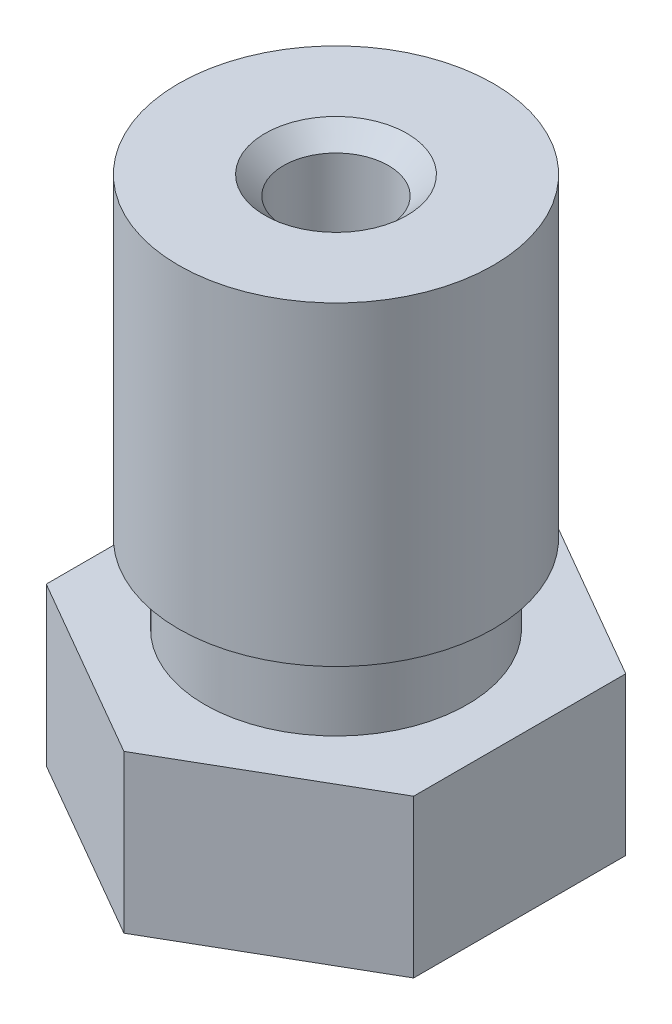
ISO-10303-21;
HEADER;
FILE_DESCRIPTION(('STEP AP214'),'2;1');
FILE_NAME('part.step','',(''),(''),'','','');
FILE_SCHEMA(('AUTOMOTIVE_DESIGN { 1 0 10303 214 1 1 1 1 }'));
ENDSEC;
DATA;
#1=APPLICATION_CONTEXT('core data for automotive mechanical design processes');
#2=APPLICATION_PROTOCOL_DEFINITION('international standard','automotive_design',2000,#1);
#3=PRODUCT_CONTEXT('',#1,'mechanical');
#4=PRODUCT('Part','Part','',(#3));
#5=PRODUCT_RELATED_PRODUCT_CATEGORY('part','',(#4));
#6=PRODUCT_DEFINITION_FORMATION('','',#4);
#7=PRODUCT_DEFINITION_CONTEXT('part definition',#1,'design');
#8=PRODUCT_DEFINITION('design','',#6,#7);
#9=PRODUCT_DEFINITION_SHAPE('','',#8);
#10=(LENGTH_UNIT() NAMED_UNIT(*) SI_UNIT(.MILLI.,.METRE.));
#11=(NAMED_UNIT(*) PLANE_ANGLE_UNIT() SI_UNIT($,.RADIAN.));
#12=(NAMED_UNIT(*) SI_UNIT($,.STERADIAN.) SOLID_ANGLE_UNIT());
#13=UNCERTAINTY_MEASURE_WITH_UNIT(LENGTH_MEASURE(1.E-05),#10,'distance_accuracy_value','');
#14=(GEOMETRIC_REPRESENTATION_CONTEXT(3) GLOBAL_UNCERTAINTY_ASSIGNED_CONTEXT((#13)) GLOBAL_UNIT_ASSIGNED_CONTEXT((#10,
#11,#12)) REPRESENTATION_CONTEXT('',''));
#15=CARTESIAN_POINT('',(0.,0.,0.));
#16=DIRECTION('',(0.,0.,1.));
#17=DIRECTION('',(1.,0.,0.));
#18=AXIS2_PLACEMENT_3D('',#15,#16,#17);
#19=CARTESIAN_POINT('',(0.,12.5,0.));
#20=DIRECTION('',(0.,1.,0.));
#21=DIRECTION('',(0.,0.,1.));
#22=AXIS2_PLACEMENT_3D('',#19,#20,#21);
#23=PLANE('',#22);
#24=CARTESIAN_POINT('',(0.,12.5,0.));
#25=DIRECTION('',(0.,-1.,0.));
#26=DIRECTION('',(0.,0.,-1.));
#27=AXIS2_PLACEMENT_3D('',#24,#25,#26);
#28=CIRCLE('',#27,1.35355339059327);
#29=CARTESIAN_POINT('',(0.,12.5,-1.35355339059327));
#30=VERTEX_POINT('',#29);
#31=EDGE_CURVE('E108',#30,#30,#28,.T.);
#32=ORIENTED_EDGE('',*,*,#31,.T.);
#33=EDGE_LOOP('',(#32));
#34=FACE_BOUND('',#33,.T.);
#35=CARTESIAN_POINT('',(0.,12.5,0.));
#36=DIRECTION('',(0.,-1.,0.));
#37=DIRECTION('',(0.,0.,-1.));
#38=AXIS2_PLACEMENT_3D('',#35,#36,#37);
#39=CIRCLE('',#38,3.);
#40=CARTESIAN_POINT('',(0.,12.5,-3.));
#41=VERTEX_POINT('',#40);
#42=EDGE_CURVE('E367',#41,#41,#39,.T.);
#43=ORIENTED_EDGE('',*,*,#42,.F.);
#44=EDGE_LOOP('',(#43));
#45=FACE_BOUND('',#44,.T.);
#46=ADVANCED_FACE('F35',(#34,#45),#23,.T.);
#47=CARTESIAN_POINT('',(0.,0.,0.));
#48=DIRECTION('',(0.,1.,0.));
#49=DIRECTION('',(0.,0.,1.));
#50=AXIS2_PLACEMENT_3D('',#47,#48,#49);
#51=PLANE('',#50);
#52=CARTESIAN_POINT('',(0.,0.,0.));
#53=DIRECTION('',(0.,-1.,0.));
#54=DIRECTION('',(0.,0.,-1.));
#55=AXIS2_PLACEMENT_3D('',#52,#53,#54);
#56=CIRCLE('',#55,0.2);
#57=CARTESIAN_POINT('',(0.,0.,-0.2));
#58=VERTEX_POINT('',#57);
#59=EDGE_CURVE('E141',#58,#58,#56,.T.);
#60=ORIENTED_EDGE('',*,*,#59,.F.);
#61=EDGE_LOOP('',(#60));
#62=FACE_BOUND('',#61,.T.);
#63=CARTESIAN_POINT('',(0.,0.,0.));
#64=DIRECTION('',(0.,-1.,0.));
#65=DIRECTION('',(0.,0.,-1.));
#66=AXIS2_PLACEMENT_3D('',#63,#64,#65);
#67=CIRCLE('',#66,0.5);
#68=CARTESIAN_POINT('',(0.,0.,-0.5));
#69=VERTEX_POINT('',#68);
#70=EDGE_CURVE('E364',#69,#69,#67,.T.);
#71=ORIENTED_EDGE('',*,*,#70,.T.);
#72=EDGE_LOOP('',(#71));
#73=FACE_BOUND('',#72,.T.);
#74=ADVANCED_FACE('F166',(#62,#73),#51,.F.);
#75=CARTESIAN_POINT('',(0.,12.5,0.));
#76=DIRECTION('',(0.,1.,0.));
#77=DIRECTION('',(0.,0.,1.));
#78=AXIS2_PLACEMENT_3D('',#75,#76,#77);
#79=CONICAL_SURFACE('',#78,1.35355339059327,0.785398163397453);
#80=CARTESIAN_POINT('',(0.,12.1464466094067,0.));
#81=DIRECTION('',(0.,-1.,0.));
#82=DIRECTION('',(0.,0.,-1.));
#83=AXIS2_PLACEMENT_3D('',#80,#81,#82);
#84=CIRCLE('',#83,0.999999999999999);
#85=CARTESIAN_POINT('',(0.,12.1464466094067,-0.999999999999999));
#86=VERTEX_POINT('',#85);
#87=EDGE_CURVE('E156',#86,#86,#84,.T.);
#88=ORIENTED_EDGE('',*,*,#87,.T.);
#89=EDGE_LOOP('',(#88));
#90=FACE_BOUND('',#89,.T.);
#91=ORIENTED_EDGE('',*,*,#31,.F.);
#92=EDGE_LOOP('',(#91));
#93=FACE_BOUND('',#92,.T.);
#94=ADVANCED_FACE('F163',(#90,#93),#79,.F.);
#95=CARTESIAN_POINT('',(0.,0.,0.));
#96=DIRECTION('',(0.,-1.,0.));
#97=DIRECTION('',(0.,0.,-1.));
#98=AXIS2_PLACEMENT_3D('',#95,#96,#97);
#99=CYLINDRICAL_SURFACE('',#98,0.999999999999999);
#100=CARTESIAN_POINT('',(0.,2.,0.));
#101=DIRECTION('',(0.,-1.,0.));
#102=DIRECTION('',(0.,0.,-1.));
#103=AXIS2_PLACEMENT_3D('',#100,#101,#102);
#104=CIRCLE('',#103,1.);
#105=CARTESIAN_POINT('',(0.,2.,-1.));
#106=VERTEX_POINT('',#105);
#107=EDGE_CURVE('E153',#106,#106,#104,.T.);
#108=ORIENTED_EDGE('',*,*,#107,.T.);
#109=EDGE_LOOP('',(#108));
#110=FACE_BOUND('',#109,.T.);
#111=ORIENTED_EDGE('',*,*,#87,.F.);
#112=EDGE_LOOP('',(#111));
#113=FACE_BOUND('',#112,.T.);
#114=ADVANCED_FACE('F165',(#110,#113),#99,.F.);
#115=CARTESIAN_POINT('',(0.,2.,0.));
#116=DIRECTION('',(0.,1.,0.));
#117=DIRECTION('',(0.,0.,1.));
#118=AXIS2_PLACEMENT_3D('',#115,#116,#117);
#119=CONICAL_SURFACE('',#118,1.,0.785398163397448);
#120=CARTESIAN_POINT('',(0.,1.75,0.));
#121=DIRECTION('',(0.,-1.,0.));
#122=DIRECTION('',(0.,0.,-1.));
#123=AXIS2_PLACEMENT_3D('',#120,#121,#122);
#124=CIRCLE('',#123,0.75);
#125=CARTESIAN_POINT('',(0.,1.75,-0.75));
#126=VERTEX_POINT('',#125);
#127=EDGE_CURVE('E150',#126,#126,#124,.T.);
#128=ORIENTED_EDGE('',*,*,#127,.T.);
#129=EDGE_LOOP('',(#128));
#130=FACE_BOUND('',#129,.T.);
#131=ORIENTED_EDGE('',*,*,#107,.F.);
#132=EDGE_LOOP('',(#131));
#133=FACE_BOUND('',#132,.T.);
#134=ADVANCED_FACE('F173',(#130,#133),#119,.F.);
#135=CARTESIAN_POINT('',(0.,0.,0.));
#136=DIRECTION('',(0.,-1.,0.));
#137=DIRECTION('',(0.,0.,-1.));
#138=AXIS2_PLACEMENT_3D('',#135,#136,#137);
#139=CYLINDRICAL_SURFACE('',#138,0.75);
#140=CARTESIAN_POINT('',(0.,1.05,0.));
#141=DIRECTION('',(0.,-1.,0.));
#142=DIRECTION('',(0.,0.,-1.));
#143=AXIS2_PLACEMENT_3D('',#140,#141,#142);
#144=CIRCLE('',#143,0.75);
#145=CARTESIAN_POINT('',(0.,1.05,-0.75));
#146=VERTEX_POINT('',#145);
#147=EDGE_CURVE('E147',#146,#146,#144,.T.);
#148=ORIENTED_EDGE('',*,*,#147,.T.);
#149=EDGE_LOOP('',(#148));
#150=FACE_BOUND('',#149,.T.);
#151=ORIENTED_EDGE('',*,*,#127,.F.);
#152=EDGE_LOOP('',(#151));
#153=FACE_BOUND('',#152,.T.);
#154=ADVANCED_FACE('F308',(#150,#153),#139,.F.);
#155=CARTESIAN_POINT('',(0.,1.05,0.));
#156=DIRECTION('',(0.,1.,0.));
#157=DIRECTION('',(0.,0.,1.));
#158=AXIS2_PLACEMENT_3D('',#155,#156,#157);
#159=CONICAL_SURFACE('',#158,0.75,0.78539816339745);
#160=CARTESIAN_POINT('',(0.,0.500000000000002,0.));
#161=DIRECTION('',(0.,-1.,0.));
#162=DIRECTION('',(0.,0.,-1.));
#163=AXIS2_PLACEMENT_3D('',#160,#161,#162);
#164=CIRCLE('',#163,0.2);
#165=CARTESIAN_POINT('',(0.,0.500000000000002,-0.2));
#166=VERTEX_POINT('',#165);
#167=EDGE_CURVE('E144',#166,#166,#164,.T.);
#168=ORIENTED_EDGE('',*,*,#167,.T.);
#169=EDGE_LOOP('',(#168));
#170=FACE_BOUND('',#169,.T.);
#171=ORIENTED_EDGE('',*,*,#147,.F.);
#172=EDGE_LOOP('',(#171));
#173=FACE_BOUND('',#172,.T.);
#174=ADVANCED_FACE('F298',(#170,#173),#159,.F.);
#175=CARTESIAN_POINT('',(0.,0.,0.));
#176=DIRECTION('',(0.,-1.,0.));
#177=DIRECTION('',(0.,0.,-1.));
#178=AXIS2_PLACEMENT_3D('',#175,#176,#177);
#179=CYLINDRICAL_SURFACE('',#178,0.2);
#180=ORIENTED_EDGE('',*,*,#59,.T.);
#181=EDGE_LOOP('',(#180));
#182=FACE_BOUND('',#181,.T.);
#183=ORIENTED_EDGE('',*,*,#167,.F.);
#184=EDGE_LOOP('',(#183));
#185=FACE_BOUND('',#184,.T.);
#186=ADVANCED_FACE('F288',(#182,#185),#179,.F.);
#187=CARTESIAN_POINT('',(-1.90041507641941,2.,0.));
#188=DIRECTION('',(0.,-1.,0.));
#189=DIRECTION('',(0.,0.,-1.));
#190=AXIS2_PLACEMENT_3D('',#187,#188,#189);
#191=PLANE('',#190);
#192=CARTESIAN_POINT('',(0.,2.,0.));
#193=DIRECTION('',(0.,-1.,0.));
#194=DIRECTION('',(0.,0.,-1.));
#195=AXIS2_PLACEMENT_3D('',#192,#193,#194);
#196=CIRCLE('',#195,1.90041507641941);
#197=CARTESIAN_POINT('',(0.,2.,-1.90041507641941));
#198=VERTEX_POINT('',#197);
#199=EDGE_CURVE('E366',#198,#198,#196,.T.);
#200=ORIENTED_EDGE('',*,*,#199,.F.);
#201=EDGE_LOOP('',(#200));
#202=FACE_BOUND('',#201,.T.);
#203=DIRECTION('',(0.866025403784442,0.,0.499999999999995));
#204=VECTOR('',#203,1.);
#205=CARTESIAN_POINT('',(3.49999999999997,2.,-2.02072594216373));
#206=LINE('',#205,#204);
#207=CARTESIAN_POINT('',(0.,2.,-4.04145188432738));
#208=VERTEX_POINT('',#207);
#209=CARTESIAN_POINT('',(3.49999999999997,2.,-2.02072594216373));
#210=VERTEX_POINT('',#209);
#211=EDGE_CURVE('E57',#208,#210,#206,.T.);
#212=ORIENTED_EDGE('',*,*,#211,.T.);
#213=DIRECTION('',(0.,0.,1.));
#214=VECTOR('',#213,1.);
#215=CARTESIAN_POINT('',(3.50000000000001,2.,2.02072594216365));
#216=LINE('',#215,#214);
#217=CARTESIAN_POINT('',(3.50000000000001,2.,2.02072594216365));
#218=VERTEX_POINT('',#217);
#219=EDGE_CURVE('E43',#210,#218,#216,.T.);
#220=ORIENTED_EDGE('',*,*,#219,.T.);
#221=DIRECTION('',(-0.866025403784435,0.,0.500000000000007));
#222=VECTOR('',#221,1.);
#223=CARTESIAN_POINT('',(0.,2.,4.04145188432738));
#224=LINE('',#223,#222);
#225=CARTESIAN_POINT('',(0.,2.,4.04145188432738));
#226=VERTEX_POINT('',#225);
#227=EDGE_CURVE('E86',#218,#226,#224,.T.);
#228=ORIENTED_EDGE('',*,*,#227,.T.);
#229=DIRECTION('',(-0.866025403784442,0.,-0.499999999999995));
#230=VECTOR('',#229,1.);
#231=CARTESIAN_POINT('',(-3.49999999999999,2.,2.0207259421637));
#232=LINE('',#231,#230);
#233=CARTESIAN_POINT('',(-3.49999999999999,2.,2.0207259421637));
#234=VERTEX_POINT('',#233);
#235=EDGE_CURVE('E100',#226,#234,#232,.T.);
#236=ORIENTED_EDGE('',*,*,#235,.T.);
#237=DIRECTION('',(0.,0.,-1.));
#238=VECTOR('',#237,1.);
#239=CARTESIAN_POINT('',(-3.5,2.,-2.02072594216368));
#240=LINE('',#239,#238);
#241=CARTESIAN_POINT('',(-3.5,2.,-2.02072594216368));
#242=VERTEX_POINT('',#241);
#243=EDGE_CURVE('E132',#234,#242,#240,.T.);
#244=ORIENTED_EDGE('',*,*,#243,.T.);
#245=DIRECTION('',(0.866025403784438,0.,-0.500000000000001));
#246=VECTOR('',#245,1.);
#247=CARTESIAN_POINT('',(0.,2.,-4.04145188432738));
#248=LINE('',#247,#246);
#249=EDGE_CURVE('E124',#242,#208,#248,.T.);
#250=ORIENTED_EDGE('',*,*,#249,.T.);
#251=EDGE_LOOP('',(#212,#220,#228,#236,#244,#250));
#252=FACE_BOUND('',#251,.T.);
#253=ADVANCED_FACE('F85',(#202,#252),#191,.T.);
#254=CARTESIAN_POINT('',(0.,0.,0.));
#255=DIRECTION('',(0.,1.,0.));
#256=DIRECTION('',(0.,0.,1.));
#257=AXIS2_PLACEMENT_3D('',#254,#255,#256);
#258=CONICAL_SURFACE('',#257,0.5,0.610865238198014);
#259=ORIENTED_EDGE('',*,*,#199,.T.);
#260=EDGE_LOOP('',(#259));
#261=FACE_BOUND('',#260,.T.);
#262=ORIENTED_EDGE('',*,*,#70,.F.);
#263=EDGE_LOOP('',(#262));
#264=FACE_BOUND('',#263,.T.);
#265=ADVANCED_FACE('F269',(#261,#264),#258,.T.);
#266=CARTESIAN_POINT('',(-4.53928342424268,5.,0.));
#267=DIRECTION('',(0.,1.,0.));
#268=DIRECTION('',(0.,0.,1.));
#269=AXIS2_PLACEMENT_3D('',#266,#267,#268);
#270=PLANE('',#269);
#271=CARTESIAN_POINT('',(0.,5.,0.));
#272=DIRECTION('',(0.,-1.,0.));
#273=DIRECTION('',(0.,0.,-1.));
#274=AXIS2_PLACEMENT_3D('',#271,#272,#273);
#275=CIRCLE('',#274,2.5);
#276=CARTESIAN_POINT('',(0.,5.,-2.5));
#277=VERTEX_POINT('',#276);
#278=EDGE_CURVE('E370',#277,#277,#275,.T.);
#279=ORIENTED_EDGE('',*,*,#278,.T.);
#280=EDGE_LOOP('',(#279));
#281=FACE_BOUND('',#280,.T.);
#282=DIRECTION('',(-0.866025403784442,0.,-0.499999999999995));
#283=VECTOR('',#282,1.);
#284=CARTESIAN_POINT('',(3.49999999999997,5.,-2.02072594216373));
#285=LINE('',#284,#283);
#286=CARTESIAN_POINT('',(3.49999999999997,5.,-2.02072594216373));
#287=VERTEX_POINT('',#286);
#288=CARTESIAN_POINT('',(0.,5.,-4.04145188432738));
#289=VERTEX_POINT('',#288);
#290=EDGE_CURVE('E128',#287,#289,#285,.T.);
#291=ORIENTED_EDGE('',*,*,#290,.T.);
#292=DIRECTION('',(-0.866025403784438,0.,0.500000000000001));
#293=VECTOR('',#292,1.);
#294=CARTESIAN_POINT('',(0.,5.,-4.04145188432738));
#295=LINE('',#294,#293);
#296=CARTESIAN_POINT('',(-3.5,5.,-2.02072594216368));
#297=VERTEX_POINT('',#296);
#298=EDGE_CURVE('E125',#289,#297,#295,.T.);
#299=ORIENTED_EDGE('',*,*,#298,.T.);
#300=DIRECTION('',(0.,0.,1.));
#301=VECTOR('',#300,1.);
#302=CARTESIAN_POINT('',(-3.5,5.,-2.02072594216368));
#303=LINE('',#302,#301);
#304=CARTESIAN_POINT('',(-3.49999999999999,5.,2.0207259421637));
#305=VERTEX_POINT('',#304);
#306=EDGE_CURVE('E137',#297,#305,#303,.T.);
#307=ORIENTED_EDGE('',*,*,#306,.T.);
#308=DIRECTION('',(0.866025403784442,0.,0.499999999999995));
#309=VECTOR('',#308,1.);
#310=CARTESIAN_POINT('',(-3.49999999999999,5.,2.0207259421637));
#311=LINE('',#310,#309);
#312=CARTESIAN_POINT('',(0.,5.,4.04145188432738));
#313=VERTEX_POINT('',#312);
#314=EDGE_CURVE('E130',#305,#313,#311,.T.);
#315=ORIENTED_EDGE('',*,*,#314,.T.);
#316=DIRECTION('',(0.866025403784435,0.,-0.500000000000007));
#317=VECTOR('',#316,1.);
#318=CARTESIAN_POINT('',(0.,5.,4.04145188432738));
#319=LINE('',#318,#317);
#320=CARTESIAN_POINT('',(3.50000000000001,5.,2.02072594216365));
#321=VERTEX_POINT('',#320);
#322=EDGE_CURVE('E49',#313,#321,#319,.T.);
#323=ORIENTED_EDGE('',*,*,#322,.T.);
#324=DIRECTION('',(0.,0.,-1.));
#325=VECTOR('',#324,1.);
#326=CARTESIAN_POINT('',(3.50000000000001,5.,2.02072594216365));
#327=LINE('',#326,#325);
#328=EDGE_CURVE('E11',#321,#287,#327,.T.);
#329=ORIENTED_EDGE('',*,*,#328,.T.);
#330=EDGE_LOOP('',(#291,#299,#307,#315,#323,#329));
#331=FACE_BOUND('',#330,.T.);
#332=ADVANCED_FACE('F259',(#281,#331),#270,.T.);
#333=CARTESIAN_POINT('',(0.,6.21132486540519,0.));
#334=DIRECTION('',(0.,1.,0.));
#335=DIRECTION('',(0.,0.,1.));
#336=AXIS2_PLACEMENT_3D('',#333,#334,#335);
#337=CONICAL_SURFACE('',#336,2.5,1.0471975511966);
#338=CARTESIAN_POINT('',(0.,6.5,0.));
#339=DIRECTION('',(0.,-1.,0.));
#340=DIRECTION('',(0.,0.,-1.));
#341=AXIS2_PLACEMENT_3D('',#338,#339,#340);
#342=CIRCLE('',#341,3.);
#343=CARTESIAN_POINT('',(0.,6.5,-3.));
#344=VERTEX_POINT('',#343);
#345=EDGE_CURVE('E373',#344,#344,#342,.T.);
#346=ORIENTED_EDGE('',*,*,#345,.T.);
#347=EDGE_LOOP('',(#346));
#348=FACE_BOUND('',#347,.T.);
#349=CARTESIAN_POINT('',(0.,6.21132486540519,0.));
#350=DIRECTION('',(0.,-1.,0.));
#351=DIRECTION('',(0.,0.,-1.));
#352=AXIS2_PLACEMENT_3D('',#349,#350,#351);
#353=CIRCLE('',#352,2.5);
#354=CARTESIAN_POINT('',(0.,6.21132486540519,-2.5));
#355=VERTEX_POINT('',#354);
#356=EDGE_CURVE('E101',#355,#355,#353,.T.);
#357=ORIENTED_EDGE('',*,*,#356,.F.);
#358=EDGE_LOOP('',(#357));
#359=FACE_BOUND('',#358,.T.);
#360=ADVANCED_FACE('F249',(#348,#359),#337,.T.);
#361=CARTESIAN_POINT('',(0.,0.,0.));
#362=DIRECTION('',(0.,-1.,0.));
#363=DIRECTION('',(0.,0.,-1.));
#364=AXIS2_PLACEMENT_3D('',#361,#362,#363);
#365=CYLINDRICAL_SURFACE('',#364,2.5);
#366=ORIENTED_EDGE('',*,*,#356,.T.);
#367=EDGE_LOOP('',(#366));
#368=FACE_BOUND('',#367,.T.);
#369=ORIENTED_EDGE('',*,*,#278,.F.);
#370=EDGE_LOOP('',(#369));
#371=FACE_BOUND('',#370,.T.);
#372=ADVANCED_FACE('F239',(#368,#371),#365,.T.);
#373=CARTESIAN_POINT('',(0.,0.,0.));
#374=DIRECTION('',(0.,-1.,0.));
#375=DIRECTION('',(0.,0.,-1.));
#376=AXIS2_PLACEMENT_3D('',#373,#374,#375);
#377=CYLINDRICAL_SURFACE('',#376,3.);
#378=ORIENTED_EDGE('',*,*,#42,.T.);
#379=EDGE_LOOP('',(#378));
#380=FACE_BOUND('',#379,.T.);
#381=ORIENTED_EDGE('',*,*,#345,.F.);
#382=EDGE_LOOP('',(#381));
#383=FACE_BOUND('',#382,.T.);
#384=ADVANCED_FACE('F185',(#380,#383),#377,.T.);
#385=CARTESIAN_POINT('',(3.50000000000001,12.5,2.02072594216365));
#386=DIRECTION('',(-1.,0.,0.));
#387=DIRECTION('',(0.,0.,1.));
#388=AXIS2_PLACEMENT_3D('',#385,#386,#387);
#389=PLANE('',#388);
#390=ORIENTED_EDGE('',*,*,#328,.F.);
#391=DIRECTION('',(0.,-1.,0.));
#392=VECTOR('',#391,1.);
#393=CARTESIAN_POINT('',(3.50000000000001,12.5,2.02072594216365));
#394=LINE('',#393,#392);
#395=EDGE_CURVE('E97',#321,#218,#394,.T.);
#396=ORIENTED_EDGE('',*,*,#395,.T.);
#397=ORIENTED_EDGE('',*,*,#219,.F.);
#398=DIRECTION('',(0.,-1.,0.));
#399=VECTOR('',#398,1.);
#400=CARTESIAN_POINT('',(3.49999999999997,12.5,-2.02072594216373));
#401=LINE('',#400,#399);
#402=EDGE_CURVE('E104',#287,#210,#401,.T.);
#403=ORIENTED_EDGE('',*,*,#402,.F.);
#404=EDGE_LOOP('',(#390,#396,#397,#403));
#405=FACE_BOUND('',#404,.T.);
#406=ADVANCED_FACE('F103',(#405),#389,.F.);
#407=CARTESIAN_POINT('',(0.,12.5,4.04145188432738));
#408=DIRECTION('',(-0.500000000000007,0.,-0.866025403784435));
#409=DIRECTION('',(-0.866025403784435,0.,0.500000000000007));
#410=AXIS2_PLACEMENT_3D('',#407,#408,#409);
#411=PLANE('',#410);
#412=ORIENTED_EDGE('',*,*,#322,.F.);
#413=DIRECTION('',(0.,-1.,0.));
#414=VECTOR('',#413,1.);
#415=CARTESIAN_POINT('',(0.,12.5,4.04145188432738));
#416=LINE('',#415,#414);
#417=EDGE_CURVE('E99',#313,#226,#416,.T.);
#418=ORIENTED_EDGE('',*,*,#417,.T.);
#419=ORIENTED_EDGE('',*,*,#227,.F.);
#420=ORIENTED_EDGE('',*,*,#395,.F.);
#421=EDGE_LOOP('',(#412,#418,#419,#420));
#422=FACE_BOUND('',#421,.T.);
#423=ADVANCED_FACE('F96',(#422),#411,.F.);
#424=CARTESIAN_POINT('',(-3.49999999999999,12.5,2.0207259421637));
#425=DIRECTION('',(0.499999999999995,0.,-0.866025403784442));
#426=DIRECTION('',(-0.866025403784442,0.,-0.499999999999995));
#427=AXIS2_PLACEMENT_3D('',#424,#425,#426);
#428=PLANE('',#427);
#429=ORIENTED_EDGE('',*,*,#314,.F.);
#430=DIRECTION('',(0.,-1.,0.));
#431=VECTOR('',#430,1.);
#432=CARTESIAN_POINT('',(-3.49999999999999,12.5,2.0207259421637));
#433=LINE('',#432,#431);
#434=EDGE_CURVE('E106',#305,#234,#433,.T.);
#435=ORIENTED_EDGE('',*,*,#434,.T.);
#436=ORIENTED_EDGE('',*,*,#235,.F.);
#437=ORIENTED_EDGE('',*,*,#417,.F.);
#438=EDGE_LOOP('',(#429,#435,#436,#437));
#439=FACE_BOUND('',#438,.T.);
#440=ADVANCED_FACE('F188',(#439),#428,.F.);
#441=CARTESIAN_POINT('',(-3.5,12.5,-2.02072594216368));
#442=DIRECTION('',(1.,0.,0.));
#443=DIRECTION('',(0.,0.,-1.));
#444=AXIS2_PLACEMENT_3D('',#441,#442,#443);
#445=PLANE('',#444);
#446=ORIENTED_EDGE('',*,*,#306,.F.);
#447=DIRECTION('',(0.,-1.,0.));
#448=VECTOR('',#447,1.);
#449=CARTESIAN_POINT('',(-3.5,12.5,-2.02072594216368));
#450=LINE('',#449,#448);
#451=EDGE_CURVE('E114',#297,#242,#450,.T.);
#452=ORIENTED_EDGE('',*,*,#451,.T.);
#453=ORIENTED_EDGE('',*,*,#243,.F.);
#454=ORIENTED_EDGE('',*,*,#434,.F.);
#455=EDGE_LOOP('',(#446,#452,#453,#454));
#456=FACE_BOUND('',#455,.T.);
#457=ADVANCED_FACE('F191',(#456),#445,.F.);
#458=CARTESIAN_POINT('',(0.,12.5,-4.04145188432738));
#459=DIRECTION('',(0.500000000000001,0.,0.866025403784438));
#460=DIRECTION('',(0.866025403784438,0.,-0.500000000000001));
#461=AXIS2_PLACEMENT_3D('',#458,#459,#460);
#462=PLANE('',#461);
#463=ORIENTED_EDGE('',*,*,#298,.F.);
#464=DIRECTION('',(0.,-1.,0.));
#465=VECTOR('',#464,1.);
#466=CARTESIAN_POINT('',(0.,12.5,-4.04145188432738));
#467=LINE('',#466,#465);
#468=EDGE_CURVE('E92',#289,#208,#467,.T.);
#469=ORIENTED_EDGE('',*,*,#468,.T.);
#470=ORIENTED_EDGE('',*,*,#249,.F.);
#471=ORIENTED_EDGE('',*,*,#451,.F.);
#472=EDGE_LOOP('',(#463,#469,#470,#471));
#473=FACE_BOUND('',#472,.T.);
#474=ADVANCED_FACE('F122',(#473),#462,.F.);
#475=CARTESIAN_POINT('',(3.49999999999997,12.5,-2.02072594216373));
#476=DIRECTION('',(-0.499999999999995,0.,0.866025403784442));
#477=DIRECTION('',(0.866025403784442,0.,0.499999999999995));
#478=AXIS2_PLACEMENT_3D('',#475,#476,#477);
#479=PLANE('',#478);
#480=ORIENTED_EDGE('',*,*,#290,.F.);
#481=ORIENTED_EDGE('',*,*,#402,.T.);
#482=ORIENTED_EDGE('',*,*,#211,.F.);
#483=ORIENTED_EDGE('',*,*,#468,.F.);
#484=EDGE_LOOP('',(#480,#481,#482,#483));
#485=FACE_BOUND('',#484,.T.);
#486=ADVANCED_FACE('F37',(#485),#479,.F.);
#487=CLOSED_SHELL('',(#46,#74,#94,#114,#134,#154,#174,#186,#253,#265,#332,#360,#372,#384,#406,
#423,#440,#457,#474,#486));
#488=MANIFOLD_SOLID_BREP('B2',#487);
#489=ADVANCED_BREP_SHAPE_REPRESENTATION('',(#18,#488),#14);
#490=SHAPE_DEFINITION_REPRESENTATION(#9,#489);
ENDSEC;
END-ISO-10303-21;
